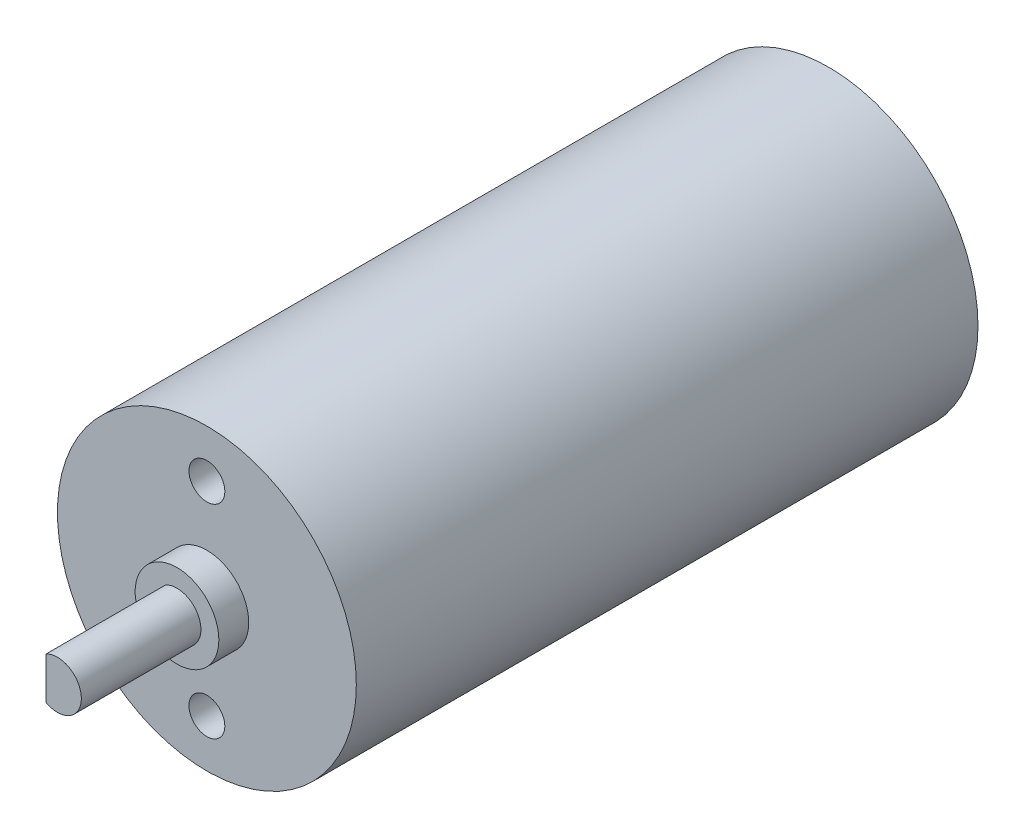
ISO-10303-21;
HEADER;
FILE_DESCRIPTION(('STEP AP214'),'2;1');
FILE_NAME('part.step','',(''),(''),'','','');
FILE_SCHEMA(('AUTOMOTIVE_DESIGN { 1 0 10303 214 1 1 1 1 }'));
ENDSEC;
DATA;
#1=APPLICATION_CONTEXT('core data for automotive mechanical design processes');
#2=APPLICATION_PROTOCOL_DEFINITION('international standard','automotive_design',2000,#1);
#3=PRODUCT_CONTEXT('',#1,'mechanical');
#4=PRODUCT('Part','Part','',(#3));
#5=PRODUCT_RELATED_PRODUCT_CATEGORY('part','',(#4));
#6=PRODUCT_DEFINITION_FORMATION('','',#4);
#7=PRODUCT_DEFINITION_CONTEXT('part definition',#1,'design');
#8=PRODUCT_DEFINITION('design','',#6,#7);
#9=PRODUCT_DEFINITION_SHAPE('','',#8);
#10=(LENGTH_UNIT() NAMED_UNIT(*) SI_UNIT(.MILLI.,.METRE.));
#11=(NAMED_UNIT(*) PLANE_ANGLE_UNIT() SI_UNIT($,.RADIAN.));
#12=(NAMED_UNIT(*) SI_UNIT($,.STERADIAN.) SOLID_ANGLE_UNIT());
#13=UNCERTAINTY_MEASURE_WITH_UNIT(LENGTH_MEASURE(1.E-05),#10,'distance_accuracy_value','');
#14=(GEOMETRIC_REPRESENTATION_CONTEXT(3) GLOBAL_UNCERTAINTY_ASSIGNED_CONTEXT((#13)) GLOBAL_UNIT_ASSIGNED_CONTEXT((#10,
#11,#12)) REPRESENTATION_CONTEXT('',''));
#15=CARTESIAN_POINT('',(0.,0.,0.));
#16=DIRECTION('',(0.,0.,1.));
#17=DIRECTION('',(1.,0.,0.));
#18=AXIS2_PLACEMENT_3D('',#15,#16,#17);
#19=CARTESIAN_POINT('',(0.,0.,52.));
#20=DIRECTION('',(0.,0.,-1.));
#21=DIRECTION('',(-1.,0.,0.));
#22=AXIS2_PLACEMENT_3D('',#19,#20,#21);
#23=CYLINDRICAL_SURFACE('',#22,12.5);
#24=CARTESIAN_POINT('',(0.,0.,52.));
#25=DIRECTION('',(0.,0.,1.));
#26=DIRECTION('',(1.,0.,0.));
#27=AXIS2_PLACEMENT_3D('',#24,#25,#26);
#28=CIRCLE('',#27,12.5);
#29=CARTESIAN_POINT('',(12.5,0.,52.));
#30=VERTEX_POINT('',#29);
#31=EDGE_CURVE('E92',#30,#30,#28,.T.);
#32=ORIENTED_EDGE('',*,*,#31,.F.);
#33=EDGE_LOOP('',(#32));
#34=FACE_BOUND('',#33,.T.);
#35=CARTESIAN_POINT('',(0.,0.,0.));
#36=DIRECTION('',(0.,0.,1.));
#37=DIRECTION('',(1.,0.,0.));
#38=AXIS2_PLACEMENT_3D('',#35,#36,#37);
#39=CIRCLE('',#38,12.5);
#40=CARTESIAN_POINT('',(12.5,0.,0.));
#41=VERTEX_POINT('',#40);
#42=EDGE_CURVE('E42',#41,#41,#39,.T.);
#43=ORIENTED_EDGE('',*,*,#42,.T.);
#44=EDGE_LOOP('',(#43));
#45=FACE_BOUND('',#44,.T.);
#46=ADVANCED_FACE('F39',(#34,#45),#23,.T.);
#47=CARTESIAN_POINT('',(0.,0.,52.));
#48=DIRECTION('',(0.,0.,1.));
#49=DIRECTION('',(1.,0.,0.));
#50=AXIS2_PLACEMENT_3D('',#47,#48,#49);
#51=PLANE('',#50);
#52=CARTESIAN_POINT('',(0.,8.5,52.));
#53=DIRECTION('',(0.,0.,1.));
#54=DIRECTION('',(1.,0.,0.));
#55=AXIS2_PLACEMENT_3D('',#52,#53,#54);
#56=CIRCLE('',#55,1.5);
#57=CARTESIAN_POINT('',(1.5,8.5,52.));
#58=VERTEX_POINT('',#57);
#59=EDGE_CURVE('E201',#58,#58,#56,.T.);
#60=ORIENTED_EDGE('',*,*,#59,.F.);
#61=EDGE_LOOP('',(#60));
#62=FACE_BOUND('',#61,.T.);
#63=CARTESIAN_POINT('',(0.,-8.5,52.));
#64=DIRECTION('',(0.,0.,1.));
#65=DIRECTION('',(1.,0.,0.));
#66=AXIS2_PLACEMENT_3D('',#63,#64,#65);
#67=CIRCLE('',#66,1.5);
#68=CARTESIAN_POINT('',(1.5,-8.5,52.));
#69=VERTEX_POINT('',#68);
#70=EDGE_CURVE('E193',#69,#69,#67,.T.);
#71=ORIENTED_EDGE('',*,*,#70,.F.);
#72=EDGE_LOOP('',(#71));
#73=FACE_BOUND('',#72,.T.);
#74=CARTESIAN_POINT('',(0.,0.,52.));
#75=DIRECTION('',(0.,0.,1.));
#76=DIRECTION('',(1.,0.,0.));
#77=AXIS2_PLACEMENT_3D('',#74,#75,#76);
#78=CIRCLE('',#77,3.5);
#79=CARTESIAN_POINT('',(3.5,0.,52.));
#80=VERTEX_POINT('',#79);
#81=EDGE_CURVE('E48',#80,#80,#78,.T.);
#82=ORIENTED_EDGE('',*,*,#81,.F.);
#83=EDGE_LOOP('',(#82));
#84=FACE_BOUND('',#83,.T.);
#85=ORIENTED_EDGE('',*,*,#31,.T.);
#86=EDGE_LOOP('',(#85));
#87=FACE_BOUND('',#86,.T.);
#88=ADVANCED_FACE('F105',(#62,#73,#84,#87),#51,.T.);
#89=CARTESIAN_POINT('',(0.,0.,0.));
#90=DIRECTION('',(0.,0.,1.));
#91=DIRECTION('',(1.,0.,0.));
#92=AXIS2_PLACEMENT_3D('',#89,#90,#91);
#93=PLANE('',#92);
#94=ORIENTED_EDGE('',*,*,#42,.F.);
#95=EDGE_LOOP('',(#94));
#96=FACE_BOUND('',#95,.T.);
#97=ADVANCED_FACE('F102',(#96),#93,.F.);
#98=CARTESIAN_POINT('',(0.,0.,54.5));
#99=DIRECTION('',(0.,0.,-1.));
#100=DIRECTION('',(-1.,0.,0.));
#101=AXIS2_PLACEMENT_3D('',#98,#99,#100);
#102=CYLINDRICAL_SURFACE('',#101,3.5);
#103=CARTESIAN_POINT('',(0.,0.,54.5));
#104=DIRECTION('',(0.,0.,1.));
#105=DIRECTION('',(1.,0.,0.));
#106=AXIS2_PLACEMENT_3D('',#103,#104,#105);
#107=CIRCLE('',#106,3.5);
#108=CARTESIAN_POINT('',(3.5,0.,54.5));
#109=VERTEX_POINT('',#108);
#110=EDGE_CURVE('E83',#109,#109,#107,.T.);
#111=ORIENTED_EDGE('',*,*,#110,.F.);
#112=EDGE_LOOP('',(#111));
#113=FACE_BOUND('',#112,.T.);
#114=ORIENTED_EDGE('',*,*,#81,.T.);
#115=EDGE_LOOP('',(#114));
#116=FACE_BOUND('',#115,.T.);
#117=ADVANCED_FACE('F104',(#113,#116),#102,.T.);
#118=CARTESIAN_POINT('',(0.,0.,54.5));
#119=DIRECTION('',(0.,0.,1.));
#120=DIRECTION('',(1.,0.,0.));
#121=AXIS2_PLACEMENT_3D('',#118,#119,#120);
#122=PLANE('',#121);
#123=CARTESIAN_POINT('',(0.,0.,54.5));
#124=DIRECTION('',(0.,0.,1.));
#125=DIRECTION('',(1.,0.,0.));
#126=AXIS2_PLACEMENT_3D('',#123,#124,#125);
#127=CIRCLE('',#126,2.);
#128=CARTESIAN_POINT('',(-0.957908230930037,-1.75567987432689,54.5));
#129=VERTEX_POINT('',#128);
#130=CARTESIAN_POINT('',(-0.957908230930037,1.75567987432689,54.5));
#131=VERTEX_POINT('',#130);
#132=EDGE_CURVE('E11',#129,#131,#127,.T.);
#133=ORIENTED_EDGE('',*,*,#132,.F.);
#134=DIRECTION('',(0.,1.,0.));
#135=VECTOR('',#134,1.);
#136=CARTESIAN_POINT('',(-0.957908230930037,-1.75567987432689,54.5));
#137=LINE('',#136,#135);
#138=EDGE_CURVE('E72',#129,#131,#137,.T.);
#139=ORIENTED_EDGE('',*,*,#138,.T.);
#140=EDGE_LOOP('',(#133,#139));
#141=FACE_BOUND('',#140,.T.);
#142=ORIENTED_EDGE('',*,*,#110,.T.);
#143=EDGE_LOOP('',(#142));
#144=FACE_BOUND('',#143,.T.);
#145=ADVANCED_FACE('F110',(#141,#144),#122,.T.);
#146=CARTESIAN_POINT('',(0.,0.,64.5));
#147=DIRECTION('',(0.,0.,-1.));
#148=DIRECTION('',(-1.,0.,0.));
#149=AXIS2_PLACEMENT_3D('',#146,#147,#148);
#150=CYLINDRICAL_SURFACE('',#149,2.);
#151=CARTESIAN_POINT('',(0.,0.,64.5));
#152=DIRECTION('',(0.,0.,1.));
#153=DIRECTION('',(1.,0.,0.));
#154=AXIS2_PLACEMENT_3D('',#151,#152,#153);
#155=CIRCLE('',#154,2.);
#156=CARTESIAN_POINT('',(-0.957908230930037,-1.75567987432689,64.5));
#157=VERTEX_POINT('',#156);
#158=CARTESIAN_POINT('',(-0.957908230930037,1.75567987432689,64.5));
#159=VERTEX_POINT('',#158);
#160=EDGE_CURVE('E77',#157,#159,#155,.T.);
#161=ORIENTED_EDGE('',*,*,#160,.F.);
#162=DIRECTION('',(0.,0.,1.));
#163=VECTOR('',#162,1.);
#164=CARTESIAN_POINT('',(-0.957908230930037,-1.75567987432689,54.5));
#165=LINE('',#164,#163);
#166=EDGE_CURVE('E56',#129,#157,#165,.T.);
#167=ORIENTED_EDGE('',*,*,#166,.F.);
#168=ORIENTED_EDGE('',*,*,#132,.T.);
#169=DIRECTION('',(0.,0.,1.));
#170=VECTOR('',#169,1.);
#171=CARTESIAN_POINT('',(-0.957908230930037,1.75567987432689,54.5));
#172=LINE('',#171,#170);
#173=EDGE_CURVE('E62',#131,#159,#172,.T.);
#174=ORIENTED_EDGE('',*,*,#173,.T.);
#175=EDGE_LOOP('',(#161,#167,#168,#174));
#176=FACE_BOUND('',#175,.T.);
#177=ADVANCED_FACE('F76',(#176),#150,.T.);
#178=CARTESIAN_POINT('',(0.,0.,64.5));
#179=DIRECTION('',(0.,0.,1.));
#180=DIRECTION('',(1.,0.,0.));
#181=AXIS2_PLACEMENT_3D('',#178,#179,#180);
#182=PLANE('',#181);
#183=DIRECTION('',(0.,1.,0.));
#184=VECTOR('',#183,1.);
#185=CARTESIAN_POINT('',(-0.957908230930037,-1.75567987432689,64.5));
#186=LINE('',#185,#184);
#187=EDGE_CURVE('E66',#157,#159,#186,.T.);
#188=ORIENTED_EDGE('',*,*,#187,.F.);
#189=ORIENTED_EDGE('',*,*,#160,.T.);
#190=EDGE_LOOP('',(#188,#189));
#191=FACE_BOUND('',#190,.T.);
#192=ADVANCED_FACE('F81',(#191),#182,.T.);
#193=CARTESIAN_POINT('',(-0.957908230930037,-1.75567987432689,54.5));
#194=DIRECTION('',(1.,0.,0.));
#195=DIRECTION('',(0.,0.,-1.));
#196=AXIS2_PLACEMENT_3D('',#193,#194,#195);
#197=PLANE('',#196);
#198=ORIENTED_EDGE('',*,*,#187,.T.);
#199=ORIENTED_EDGE('',*,*,#173,.F.);
#200=ORIENTED_EDGE('',*,*,#138,.F.);
#201=ORIENTED_EDGE('',*,*,#166,.T.);
#202=EDGE_LOOP('',(#198,#199,#200,#201));
#203=FACE_BOUND('',#202,.T.);
#204=ADVANCED_FACE('F67',(#203),#197,.F.);
#205=CARTESIAN_POINT('',(0.,-8.5,45.));
#206=DIRECTION('',(0.,0.,1.));
#207=DIRECTION('',(1.,0.,0.));
#208=AXIS2_PLACEMENT_3D('',#205,#206,#207);
#209=CYLINDRICAL_SURFACE('',#208,1.5);
#210=CARTESIAN_POINT('',(0.,-8.5,45.));
#211=DIRECTION('',(0.,0.,1.));
#212=DIRECTION('',(1.,0.,0.));
#213=AXIS2_PLACEMENT_3D('',#210,#211,#212);
#214=CIRCLE('',#213,1.5);
#215=CARTESIAN_POINT('',(1.5,-8.5,45.));
#216=VERTEX_POINT('',#215);
#217=EDGE_CURVE('E197',#216,#216,#214,.T.);
#218=ORIENTED_EDGE('',*,*,#217,.F.);
#219=EDGE_LOOP('',(#218));
#220=FACE_BOUND('',#219,.T.);
#221=ORIENTED_EDGE('',*,*,#70,.T.);
#222=EDGE_LOOP('',(#221));
#223=FACE_BOUND('',#222,.T.);
#224=ADVANCED_FACE('F134',(#220,#223),#209,.F.);
#225=CARTESIAN_POINT('',(0.,-8.5,45.));
#226=DIRECTION('',(0.,0.,1.));
#227=DIRECTION('',(1.,0.,0.));
#228=AXIS2_PLACEMENT_3D('',#225,#226,#227);
#229=PLANE('',#228);
#230=ORIENTED_EDGE('',*,*,#217,.T.);
#231=EDGE_LOOP('',(#230));
#232=FACE_BOUND('',#231,.T.);
#233=ADVANCED_FACE('F139',(#232),#229,.T.);
#234=CARTESIAN_POINT('',(0.,8.5,45.));
#235=DIRECTION('',(0.,0.,1.));
#236=DIRECTION('',(1.,0.,0.));
#237=AXIS2_PLACEMENT_3D('',#234,#235,#236);
#238=CYLINDRICAL_SURFACE('',#237,1.5);
#239=CARTESIAN_POINT('',(0.,8.5,45.));
#240=DIRECTION('',(0.,0.,1.));
#241=DIRECTION('',(1.,0.,0.));
#242=AXIS2_PLACEMENT_3D('',#239,#240,#241);
#243=CIRCLE('',#242,1.5);
#244=CARTESIAN_POINT('',(1.5,8.5,45.));
#245=VERTEX_POINT('',#244);
#246=EDGE_CURVE('E73',#245,#245,#243,.T.);
#247=ORIENTED_EDGE('',*,*,#246,.F.);
#248=EDGE_LOOP('',(#247));
#249=FACE_BOUND('',#248,.T.);
#250=ORIENTED_EDGE('',*,*,#59,.T.);
#251=EDGE_LOOP('',(#250));
#252=FACE_BOUND('',#251,.T.);
#253=ADVANCED_FACE('F149',(#249,#252),#238,.F.);
#254=CARTESIAN_POINT('',(0.,8.5,45.));
#255=DIRECTION('',(0.,0.,1.));
#256=DIRECTION('',(1.,0.,0.));
#257=AXIS2_PLACEMENT_3D('',#254,#255,#256);
#258=PLANE('',#257);
#259=ORIENTED_EDGE('',*,*,#246,.T.);
#260=EDGE_LOOP('',(#259));
#261=FACE_BOUND('',#260,.T.);
#262=ADVANCED_FACE('F159',(#261),#258,.T.);
#263=CLOSED_SHELL('',(#46,#88,#97,#117,#145,#177,#192,#204,#224,#233,#253,#262));
#264=MANIFOLD_SOLID_BREP('B2',#263);
#265=ADVANCED_BREP_SHAPE_REPRESENTATION('',(#18,#264),#14);
#266=SHAPE_DEFINITION_REPRESENTATION(#9,#265);
ENDSEC;
END-ISO-10303-21;
